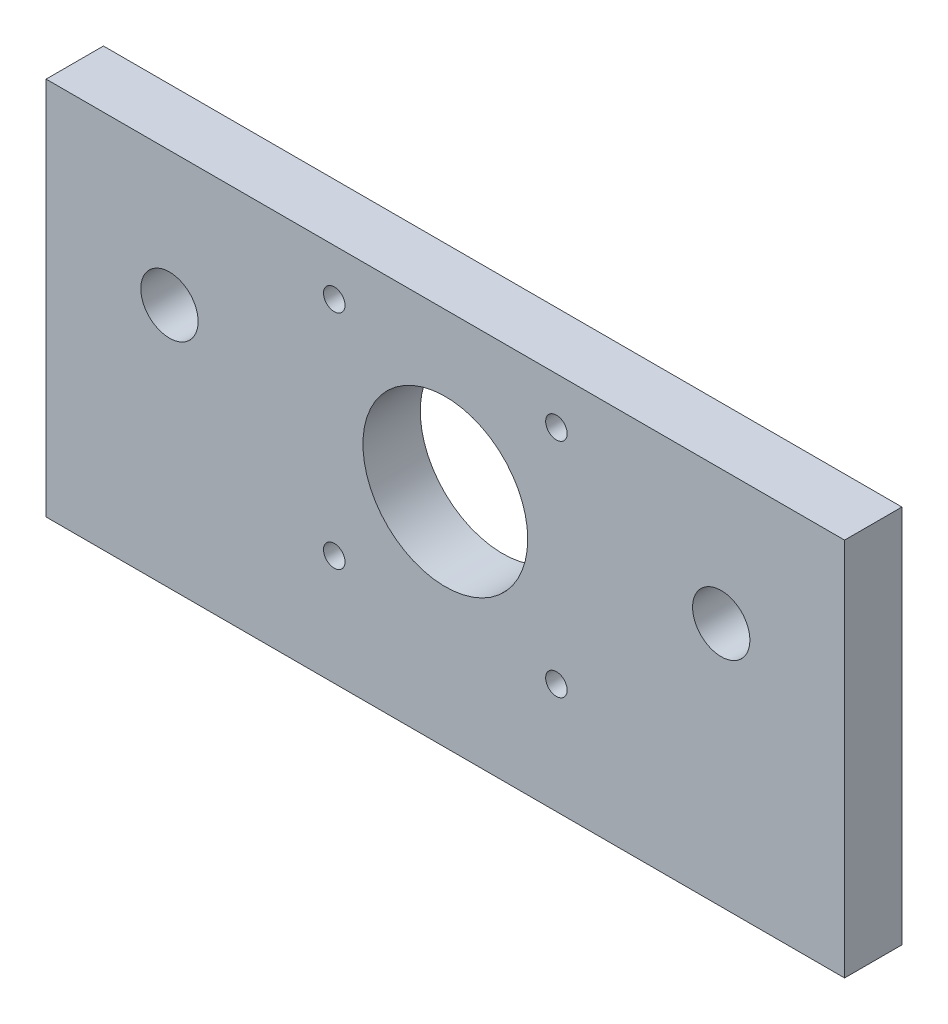
ISO-10303-21;
HEADER;
FILE_DESCRIPTION(('STEP AP214'),'2;1');
FILE_NAME('part.step','',(''),(''),'','','');
FILE_SCHEMA(('AUTOMOTIVE_DESIGN { 1 0 10303 214 1 1 1 1 }'));
ENDSEC;
DATA;
#1=APPLICATION_CONTEXT('core data for automotive mechanical design processes');
#2=APPLICATION_PROTOCOL_DEFINITION('international standard','automotive_design',2000,#1);
#3=PRODUCT_CONTEXT('',#1,'mechanical');
#4=PRODUCT('Part','Part','',(#3));
#5=PRODUCT_RELATED_PRODUCT_CATEGORY('part','',(#4));
#6=PRODUCT_DEFINITION_FORMATION('','',#4);
#7=PRODUCT_DEFINITION_CONTEXT('part definition',#1,'design');
#8=PRODUCT_DEFINITION('design','',#6,#7);
#9=PRODUCT_DEFINITION_SHAPE('','',#8);
#10=(LENGTH_UNIT() NAMED_UNIT(*) SI_UNIT(.MILLI.,.METRE.));
#11=(NAMED_UNIT(*) PLANE_ANGLE_UNIT() SI_UNIT($,.RADIAN.));
#12=(NAMED_UNIT(*) SI_UNIT($,.STERADIAN.) SOLID_ANGLE_UNIT());
#13=UNCERTAINTY_MEASURE_WITH_UNIT(LENGTH_MEASURE(1.E-05),#10,'distance_accuracy_value','');
#14=(GEOMETRIC_REPRESENTATION_CONTEXT(3) GLOBAL_UNCERTAINTY_ASSIGNED_CONTEXT((#13)) GLOBAL_UNIT_ASSIGNED_CONTEXT((#10,
#11,#12)) REPRESENTATION_CONTEXT('',''));
#15=CARTESIAN_POINT('',(0.,0.,0.));
#16=DIRECTION('',(0.,0.,1.));
#17=DIRECTION('',(1.,0.,0.));
#18=AXIS2_PLACEMENT_3D('',#15,#16,#17);
#19=CARTESIAN_POINT('',(-55.9295902988013,0.,8.));
#20=DIRECTION('',(-1.,0.,0.));
#21=DIRECTION('',(0.,0.,1.));
#22=AXIS2_PLACEMENT_3D('',#19,#20,#21);
#23=PLANE('',#22);
#24=DIRECTION('',(0.,1.,0.));
#25=VECTOR('',#24,1.);
#26=CARTESIAN_POINT('',(-55.9295902988013,0.,0.));
#27=LINE('',#26,#25);
#28=CARTESIAN_POINT('',(-55.9295902988013,-41.6378703415326,0.));
#29=VERTEX_POINT('',#28);
#30=CARTESIAN_POINT('',(-55.9295902988013,11.283196531097,0.));
#31=VERTEX_POINT('',#30);
#32=EDGE_CURVE('E127',#29,#31,#27,.T.);
#33=ORIENTED_EDGE('',*,*,#32,.F.);
#34=DIRECTION('',(0.,0.,-1.));
#35=VECTOR('',#34,1.);
#36=CARTESIAN_POINT('',(-55.9295902988013,-41.6378703415326,8.));
#37=LINE('',#36,#35);
#38=CARTESIAN_POINT('',(-55.9295902988013,-41.6378703415326,8.));
#39=VERTEX_POINT('',#38);
#40=EDGE_CURVE('E11',#39,#29,#37,.T.);
#41=ORIENTED_EDGE('',*,*,#40,.F.);
#42=DIRECTION('',(0.,1.,0.));
#43=VECTOR('',#42,1.);
#44=CARTESIAN_POINT('',(-55.9295902988013,0.,8.));
#45=LINE('',#44,#43);
#46=CARTESIAN_POINT('',(-55.9295902988013,11.283196531097,8.));
#47=VERTEX_POINT('',#46);
#48=EDGE_CURVE('E107',#39,#47,#45,.T.);
#49=ORIENTED_EDGE('',*,*,#48,.T.);
#50=DIRECTION('',(0.,0.,-1.));
#51=VECTOR('',#50,1.);
#52=CARTESIAN_POINT('',(-55.9295902988013,11.283196531097,8.));
#53=LINE('',#52,#51);
#54=EDGE_CURVE('E67',#47,#31,#53,.T.);
#55=ORIENTED_EDGE('',*,*,#54,.T.);
#56=EDGE_LOOP('',(#33,#41,#49,#55));
#57=FACE_BOUND('',#56,.T.);
#58=ADVANCED_FACE('F49',(#57),#23,.T.);
#59=CARTESIAN_POINT('',(0.,-41.6378703415326,8.));
#60=DIRECTION('',(0.,-1.,0.));
#61=DIRECTION('',(0.,0.,-1.));
#62=AXIS2_PLACEMENT_3D('',#59,#60,#61);
#63=PLANE('',#62);
#64=DIRECTION('',(-1.,0.,0.));
#65=VECTOR('',#64,1.);
#66=CARTESIAN_POINT('',(0.,-41.6378703415326,0.));
#67=LINE('',#66,#65);
#68=CARTESIAN_POINT('',(55.4962481395173,-41.6378703415326,0.));
#69=VERTEX_POINT('',#68);
#70=EDGE_CURVE('E97',#69,#29,#67,.T.);
#71=ORIENTED_EDGE('',*,*,#70,.F.);
#72=DIRECTION('',(0.,0.,-1.));
#73=VECTOR('',#72,1.);
#74=CARTESIAN_POINT('',(55.4962481395173,-41.6378703415326,8.));
#75=LINE('',#74,#73);
#76=CARTESIAN_POINT('',(55.4962481395173,-41.6378703415326,8.));
#77=VERTEX_POINT('',#76);
#78=EDGE_CURVE('E59',#77,#69,#75,.T.);
#79=ORIENTED_EDGE('',*,*,#78,.F.);
#80=DIRECTION('',(-1.,0.,0.));
#81=VECTOR('',#80,1.);
#82=CARTESIAN_POINT('',(0.,-41.6378703415326,8.));
#83=LINE('',#82,#81);
#84=EDGE_CURVE('E95',#77,#39,#83,.T.);
#85=ORIENTED_EDGE('',*,*,#84,.T.);
#86=ORIENTED_EDGE('',*,*,#40,.T.);
#87=EDGE_LOOP('',(#71,#79,#85,#86));
#88=FACE_BOUND('',#87,.T.);
#89=ADVANCED_FACE('F94',(#88),#63,.T.);
#90=CARTESIAN_POINT('',(55.4962481395173,0.,8.));
#91=DIRECTION('',(1.,0.,0.));
#92=DIRECTION('',(0.,0.,-1.));
#93=AXIS2_PLACEMENT_3D('',#90,#91,#92);
#94=PLANE('',#93);
#95=DIRECTION('',(0.,-1.,0.));
#96=VECTOR('',#95,1.);
#97=CARTESIAN_POINT('',(55.4962481395173,0.,0.));
#98=LINE('',#97,#96);
#99=CARTESIAN_POINT('',(55.4962481395173,11.283196531097,0.));
#100=VERTEX_POINT('',#99);
#101=EDGE_CURVE('E132',#100,#69,#98,.T.);
#102=ORIENTED_EDGE('',*,*,#101,.F.);
#103=DIRECTION('',(0.,0.,-1.));
#104=VECTOR('',#103,1.);
#105=CARTESIAN_POINT('',(55.4962481395173,11.283196531097,8.));
#106=LINE('',#105,#104);
#107=CARTESIAN_POINT('',(55.4962481395173,11.283196531097,8.));
#108=VERTEX_POINT('',#107);
#109=EDGE_CURVE('E80',#108,#100,#106,.T.);
#110=ORIENTED_EDGE('',*,*,#109,.F.);
#111=DIRECTION('',(0.,-1.,0.));
#112=VECTOR('',#111,1.);
#113=CARTESIAN_POINT('',(55.4962481395173,0.,8.));
#114=LINE('',#113,#112);
#115=EDGE_CURVE('E106',#108,#77,#114,.T.);
#116=ORIENTED_EDGE('',*,*,#115,.T.);
#117=ORIENTED_EDGE('',*,*,#78,.T.);
#118=EDGE_LOOP('',(#102,#110,#116,#117));
#119=FACE_BOUND('',#118,.T.);
#120=ADVANCED_FACE('F110',(#119),#94,.T.);
#121=CARTESIAN_POINT('',(38.2833289203579,-7.41680346890308,8.));
#122=DIRECTION('',(0.,0.,-1.));
#123=DIRECTION('',(-1.,0.,0.));
#124=AXIS2_PLACEMENT_3D('',#121,#122,#123);
#125=CYLINDRICAL_SURFACE('',#124,4.00000000000001);
#126=CARTESIAN_POINT('',(38.2833289203579,-7.41680346890308,8.));
#127=DIRECTION('',(0.,0.,1.));
#128=DIRECTION('',(1.,0.,0.));
#129=AXIS2_PLACEMENT_3D('',#126,#127,#128);
#130=CIRCLE('',#129,4.00000000000001);
#131=CARTESIAN_POINT('',(42.283328920358,-7.41680346890308,8.));
#132=VERTEX_POINT('',#131);
#133=EDGE_CURVE('E146',#132,#132,#130,.T.);
#134=ORIENTED_EDGE('',*,*,#133,.T.);
#135=EDGE_LOOP('',(#134));
#136=FACE_BOUND('',#135,.T.);
#137=CARTESIAN_POINT('',(38.2833289203579,-7.41680346890308,0.));
#138=DIRECTION('',(0.,0.,1.));
#139=DIRECTION('',(1.,0.,0.));
#140=AXIS2_PLACEMENT_3D('',#137,#138,#139);
#141=CIRCLE('',#140,4.00000000000001);
#142=CARTESIAN_POINT('',(42.283328920358,-7.41680346890308,0.));
#143=VERTEX_POINT('',#142);
#144=EDGE_CURVE('E122',#143,#143,#141,.T.);
#145=ORIENTED_EDGE('',*,*,#144,.F.);
#146=EDGE_LOOP('',(#145));
#147=FACE_BOUND('',#146,.T.);
#148=ADVANCED_FACE('F167',(#136,#147),#125,.F.);
#149=CARTESIAN_POINT('',(-38.716671079642,-7.41680346890299,8.));
#150=DIRECTION('',(0.,0.,-1.));
#151=DIRECTION('',(-1.,0.,0.));
#152=AXIS2_PLACEMENT_3D('',#149,#150,#151);
#153=CYLINDRICAL_SURFACE('',#152,4.);
#154=CARTESIAN_POINT('',(-38.716671079642,-7.41680346890299,8.));
#155=DIRECTION('',(0.,0.,1.));
#156=DIRECTION('',(1.,0.,0.));
#157=AXIS2_PLACEMENT_3D('',#154,#155,#156);
#158=CIRCLE('',#157,4.);
#159=CARTESIAN_POINT('',(-34.716671079642,-7.41680346890299,8.));
#160=VERTEX_POINT('',#159);
#161=EDGE_CURVE('E139',#160,#160,#158,.T.);
#162=ORIENTED_EDGE('',*,*,#161,.T.);
#163=EDGE_LOOP('',(#162));
#164=FACE_BOUND('',#163,.T.);
#165=CARTESIAN_POINT('',(-38.716671079642,-7.41680346890299,0.));
#166=DIRECTION('',(0.,0.,1.));
#167=DIRECTION('',(1.,0.,0.));
#168=AXIS2_PLACEMENT_3D('',#165,#166,#167);
#169=CIRCLE('',#168,4.);
#170=CARTESIAN_POINT('',(-34.716671079642,-7.41680346890299,0.));
#171=VERTEX_POINT('',#170);
#172=EDGE_CURVE('E118',#171,#171,#169,.T.);
#173=ORIENTED_EDGE('',*,*,#172,.F.);
#174=EDGE_LOOP('',(#173));
#175=FACE_BOUND('',#174,.T.);
#176=ADVANCED_FACE('F51',(#164,#175),#153,.F.);
#177=CARTESIAN_POINT('',(0.,11.283196531097,8.));
#178=DIRECTION('',(0.,1.,0.));
#179=DIRECTION('',(0.,0.,1.));
#180=AXIS2_PLACEMENT_3D('',#177,#178,#179);
#181=PLANE('',#180);
#182=DIRECTION('',(1.,0.,0.));
#183=VECTOR('',#182,1.);
#184=CARTESIAN_POINT('',(0.,11.283196531097,0.));
#185=LINE('',#184,#183);
#186=EDGE_CURVE('E135',#31,#100,#185,.T.);
#187=ORIENTED_EDGE('',*,*,#186,.F.);
#188=ORIENTED_EDGE('',*,*,#54,.F.);
#189=DIRECTION('',(1.,0.,0.));
#190=VECTOR('',#189,1.);
#191=CARTESIAN_POINT('',(0.,11.283196531097,8.));
#192=LINE('',#191,#190);
#193=EDGE_CURVE('E112',#47,#108,#192,.T.);
#194=ORIENTED_EDGE('',*,*,#193,.T.);
#195=ORIENTED_EDGE('',*,*,#109,.T.);
#196=EDGE_LOOP('',(#187,#188,#194,#195));
#197=FACE_BOUND('',#196,.T.);
#198=ADVANCED_FACE('F157',(#197),#181,.T.);
#199=CARTESIAN_POINT('',(0.,0.,8.));
#200=DIRECTION('',(0.,0.,1.));
#201=DIRECTION('',(1.,0.,0.));
#202=AXIS2_PLACEMENT_3D('',#199,#200,#201);
#203=PLANE('',#202);
#204=CARTESIAN_POINT('',(-15.7166710796426,-26.216803468903,8.));
#205=DIRECTION('',(0.,0.,1.));
#206=DIRECTION('',(1.,0.,0.));
#207=AXIS2_PLACEMENT_3D('',#204,#205,#206);
#208=CIRCLE('',#207,1.50000000000046);
#209=CARTESIAN_POINT('',(-14.2166710796421,-26.216803468903,8.));
#210=VERTEX_POINT('',#209);
#211=EDGE_CURVE('E218',#210,#210,#208,.T.);
#212=ORIENTED_EDGE('',*,*,#211,.F.);
#213=EDGE_LOOP('',(#212));
#214=FACE_BOUND('',#213,.T.);
#215=CARTESIAN_POINT('',(15.2833289203574,-26.216803468903,8.));
#216=DIRECTION('',(0.,0.,1.));
#217=DIRECTION('',(1.,0.,0.));
#218=AXIS2_PLACEMENT_3D('',#215,#216,#217);
#219=CIRCLE('',#218,1.50000000000234);
#220=CARTESIAN_POINT('',(16.7833289203598,-26.216803468903,8.));
#221=VERTEX_POINT('',#220);
#222=EDGE_CURVE('E226',#221,#221,#219,.T.);
#223=ORIENTED_EDGE('',*,*,#222,.F.);
#224=EDGE_LOOP('',(#223));
#225=FACE_BOUND('',#224,.T.);
#226=CARTESIAN_POINT('',(-15.7166710796426,4.78319653109701,8.));
#227=DIRECTION('',(0.,0.,1.));
#228=DIRECTION('',(1.,0.,0.));
#229=AXIS2_PLACEMENT_3D('',#226,#227,#228);
#230=CIRCLE('',#229,1.5);
#231=CARTESIAN_POINT('',(-14.2166710796426,4.78319653109701,8.));
#232=VERTEX_POINT('',#231);
#233=EDGE_CURVE('E236',#232,#232,#230,.T.);
#234=ORIENTED_EDGE('',*,*,#233,.F.);
#235=EDGE_LOOP('',(#234));
#236=FACE_BOUND('',#235,.T.);
#237=CARTESIAN_POINT('',(15.2833289203574,4.78319653109702,8.));
#238=DIRECTION('',(0.,0.,1.));
#239=DIRECTION('',(1.,0.,0.));
#240=AXIS2_PLACEMENT_3D('',#237,#238,#239);
#241=CIRCLE('',#240,1.5000000000009);
#242=CARTESIAN_POINT('',(16.7833289203583,4.78319653109702,8.));
#243=VERTEX_POINT('',#242);
#244=EDGE_CURVE('E244',#243,#243,#241,.T.);
#245=ORIENTED_EDGE('',*,*,#244,.F.);
#246=EDGE_LOOP('',(#245));
#247=FACE_BOUND('',#246,.T.);
#248=CARTESIAN_POINT('',(-0.216671079642593,-10.716803468903,8.));
#249=DIRECTION('',(0.,0.,1.));
#250=DIRECTION('',(1.,0.,0.));
#251=AXIS2_PLACEMENT_3D('',#248,#249,#250);
#252=CIRCLE('',#251,11.5);
#253=CARTESIAN_POINT('',(11.2833289203574,-10.716803468903,8.));
#254=VERTEX_POINT('',#253);
#255=EDGE_CURVE('E154',#254,#254,#252,.T.);
#256=ORIENTED_EDGE('',*,*,#255,.F.);
#257=EDGE_LOOP('',(#256));
#258=FACE_BOUND('',#257,.T.);
#259=ORIENTED_EDGE('',*,*,#161,.F.);
#260=EDGE_LOOP('',(#259));
#261=FACE_BOUND('',#260,.T.);
#262=ORIENTED_EDGE('',*,*,#133,.F.);
#263=EDGE_LOOP('',(#262));
#264=FACE_BOUND('',#263,.T.);
#265=ORIENTED_EDGE('',*,*,#48,.F.);
#266=ORIENTED_EDGE('',*,*,#84,.F.);
#267=ORIENTED_EDGE('',*,*,#115,.F.);
#268=ORIENTED_EDGE('',*,*,#193,.F.);
#269=EDGE_LOOP('',(#265,#266,#267,#268));
#270=FACE_BOUND('',#269,.T.);
#271=ADVANCED_FACE('F104',(#214,#225,#236,#247,#258,#261,#264,#270),#203,.T.);
#272=CARTESIAN_POINT('',(0.,0.,0.));
#273=DIRECTION('',(0.,0.,1.));
#274=DIRECTION('',(1.,0.,0.));
#275=AXIS2_PLACEMENT_3D('',#272,#273,#274);
#276=PLANE('',#275);
#277=CARTESIAN_POINT('',(-15.7166710796426,-26.216803468903,0.));
#278=DIRECTION('',(0.,0.,1.));
#279=DIRECTION('',(1.,0.,0.));
#280=AXIS2_PLACEMENT_3D('',#277,#278,#279);
#281=CIRCLE('',#280,1.50000000000046);
#282=CARTESIAN_POINT('',(-14.2166710796421,-26.216803468903,0.));
#283=VERTEX_POINT('',#282);
#284=EDGE_CURVE('E215',#283,#283,#281,.T.);
#285=ORIENTED_EDGE('',*,*,#284,.T.);
#286=EDGE_LOOP('',(#285));
#287=FACE_BOUND('',#286,.T.);
#288=CARTESIAN_POINT('',(15.2833289203574,-26.216803468903,0.));
#289=DIRECTION('',(0.,0.,1.));
#290=DIRECTION('',(1.,0.,0.));
#291=AXIS2_PLACEMENT_3D('',#288,#289,#290);
#292=CIRCLE('',#291,1.50000000000234);
#293=CARTESIAN_POINT('',(16.7833289203598,-26.216803468903,0.));
#294=VERTEX_POINT('',#293);
#295=EDGE_CURVE('E220',#294,#294,#292,.T.);
#296=ORIENTED_EDGE('',*,*,#295,.T.);
#297=EDGE_LOOP('',(#296));
#298=FACE_BOUND('',#297,.T.);
#299=CARTESIAN_POINT('',(-15.7166710796426,4.78319653109701,0.));
#300=DIRECTION('',(0.,0.,1.));
#301=DIRECTION('',(1.,0.,0.));
#302=AXIS2_PLACEMENT_3D('',#299,#300,#301);
#303=CIRCLE('',#302,1.5);
#304=CARTESIAN_POINT('',(-14.2166710796426,4.78319653109701,0.));
#305=VERTEX_POINT('',#304);
#306=EDGE_CURVE('E232',#305,#305,#303,.T.);
#307=ORIENTED_EDGE('',*,*,#306,.T.);
#308=EDGE_LOOP('',(#307));
#309=FACE_BOUND('',#308,.T.);
#310=CARTESIAN_POINT('',(15.2833289203574,4.78319653109702,0.));
#311=DIRECTION('',(0.,0.,1.));
#312=DIRECTION('',(1.,0.,0.));
#313=AXIS2_PLACEMENT_3D('',#310,#311,#312);
#314=CIRCLE('',#313,1.5000000000009);
#315=CARTESIAN_POINT('',(16.7833289203583,4.78319653109702,0.));
#316=VERTEX_POINT('',#315);
#317=EDGE_CURVE('E240',#316,#316,#314,.T.);
#318=ORIENTED_EDGE('',*,*,#317,.T.);
#319=EDGE_LOOP('',(#318));
#320=FACE_BOUND('',#319,.T.);
#321=CARTESIAN_POINT('',(-0.216671079642593,-10.716803468903,0.));
#322=DIRECTION('',(0.,0.,1.));
#323=DIRECTION('',(1.,0.,0.));
#324=AXIS2_PLACEMENT_3D('',#321,#322,#323);
#325=CIRCLE('',#324,11.5);
#326=CARTESIAN_POINT('',(11.2833289203574,-10.716803468903,0.));
#327=VERTEX_POINT('',#326);
#328=EDGE_CURVE('E123',#327,#327,#325,.T.);
#329=ORIENTED_EDGE('',*,*,#328,.T.);
#330=EDGE_LOOP('',(#329));
#331=FACE_BOUND('',#330,.T.);
#332=ORIENTED_EDGE('',*,*,#172,.T.);
#333=EDGE_LOOP('',(#332));
#334=FACE_BOUND('',#333,.T.);
#335=ORIENTED_EDGE('',*,*,#144,.T.);
#336=EDGE_LOOP('',(#335));
#337=FACE_BOUND('',#336,.T.);
#338=ORIENTED_EDGE('',*,*,#32,.T.);
#339=ORIENTED_EDGE('',*,*,#186,.T.);
#340=ORIENTED_EDGE('',*,*,#101,.T.);
#341=ORIENTED_EDGE('',*,*,#70,.T.);
#342=EDGE_LOOP('',(#338,#339,#340,#341));
#343=FACE_BOUND('',#342,.T.);
#344=ADVANCED_FACE('F164',(#287,#298,#309,#320,#331,#334,#337,#343),#276,.F.);
#345=CARTESIAN_POINT('',(-0.216671079642593,-10.716803468903,0.));
#346=DIRECTION('',(0.,0.,1.));
#347=DIRECTION('',(1.,0.,0.));
#348=AXIS2_PLACEMENT_3D('',#345,#346,#347);
#349=CYLINDRICAL_SURFACE('',#348,11.5);
#350=ORIENTED_EDGE('',*,*,#328,.F.);
#351=EDGE_LOOP('',(#350));
#352=FACE_BOUND('',#351,.T.);
#353=ORIENTED_EDGE('',*,*,#255,.T.);
#354=EDGE_LOOP('',(#353));
#355=FACE_BOUND('',#354,.T.);
#356=ADVANCED_FACE('F186',(#352,#355),#349,.F.);
#357=CARTESIAN_POINT('',(15.2833289203574,4.78319653109702,0.));
#358=DIRECTION('',(0.,0.,1.));
#359=DIRECTION('',(1.,0.,0.));
#360=AXIS2_PLACEMENT_3D('',#357,#358,#359);
#361=CYLINDRICAL_SURFACE('',#360,1.5000000000009);
#362=ORIENTED_EDGE('',*,*,#317,.F.);
#363=EDGE_LOOP('',(#362));
#364=FACE_BOUND('',#363,.T.);
#365=ORIENTED_EDGE('',*,*,#244,.T.);
#366=EDGE_LOOP('',(#365));
#367=FACE_BOUND('',#366,.T.);
#368=ADVANCED_FACE('F191',(#364,#367),#361,.F.);
#369=CARTESIAN_POINT('',(-15.7166710796426,4.78319653109701,0.));
#370=DIRECTION('',(0.,0.,1.));
#371=DIRECTION('',(1.,0.,0.));
#372=AXIS2_PLACEMENT_3D('',#369,#370,#371);
#373=CYLINDRICAL_SURFACE('',#372,1.5);
#374=ORIENTED_EDGE('',*,*,#306,.F.);
#375=EDGE_LOOP('',(#374));
#376=FACE_BOUND('',#375,.T.);
#377=ORIENTED_EDGE('',*,*,#233,.T.);
#378=EDGE_LOOP('',(#377));
#379=FACE_BOUND('',#378,.T.);
#380=ADVANCED_FACE('F199',(#376,#379),#373,.F.);
#381=CARTESIAN_POINT('',(15.2833289203574,-26.216803468903,0.));
#382=DIRECTION('',(0.,0.,1.));
#383=DIRECTION('',(1.,0.,0.));
#384=AXIS2_PLACEMENT_3D('',#381,#382,#383);
#385=CYLINDRICAL_SURFACE('',#384,1.50000000000234);
#386=ORIENTED_EDGE('',*,*,#295,.F.);
#387=EDGE_LOOP('',(#386));
#388=FACE_BOUND('',#387,.T.);
#389=ORIENTED_EDGE('',*,*,#222,.T.);
#390=EDGE_LOOP('',(#389));
#391=FACE_BOUND('',#390,.T.);
#392=ADVANCED_FACE('F203',(#388,#391),#385,.F.);
#393=CARTESIAN_POINT('',(-15.7166710796426,-26.216803468903,0.));
#394=DIRECTION('',(0.,0.,1.));
#395=DIRECTION('',(1.,0.,0.));
#396=AXIS2_PLACEMENT_3D('',#393,#394,#395);
#397=CYLINDRICAL_SURFACE('',#396,1.50000000000046);
#398=ORIENTED_EDGE('',*,*,#284,.F.);
#399=EDGE_LOOP('',(#398));
#400=FACE_BOUND('',#399,.T.);
#401=ORIENTED_EDGE('',*,*,#211,.T.);
#402=EDGE_LOOP('',(#401));
#403=FACE_BOUND('',#402,.T.);
#404=ADVANCED_FACE('F207',(#400,#403),#397,.F.);
#405=CLOSED_SHELL('',(#58,#89,#120,#148,#176,#198,#271,#344,#356,#368,#380,#392,#404));
#406=MANIFOLD_SOLID_BREP('B2',#405);
#407=ADVANCED_BREP_SHAPE_REPRESENTATION('',(#18,#406),#14);
#408=SHAPE_DEFINITION_REPRESENTATION(#9,#407);
ENDSEC;
END-ISO-10303-21;
